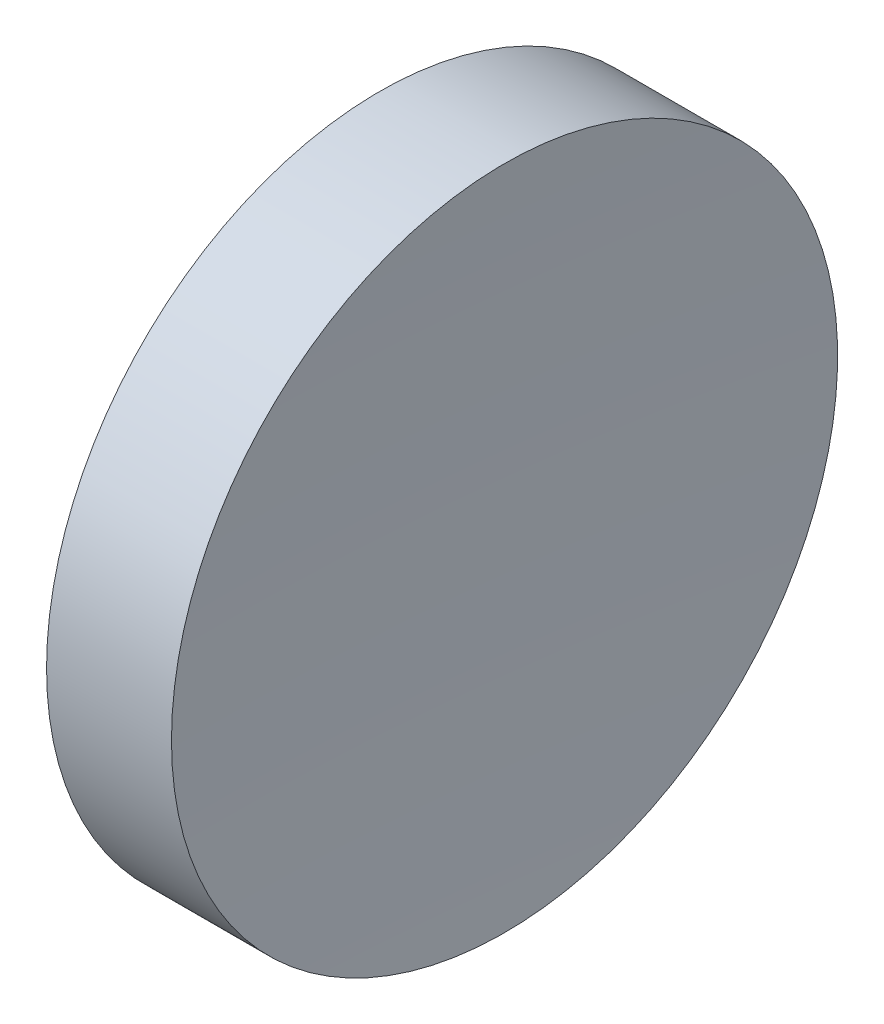
ISO-10303-21;
HEADER;
FILE_DESCRIPTION(('STEP AP214'),'2;1');
FILE_NAME('part.step','',(''),(''),'','','');
FILE_SCHEMA(('AUTOMOTIVE_DESIGN { 1 0 10303 214 1 1 1 1 }'));
ENDSEC;
DATA;
#1=APPLICATION_CONTEXT('core data for automotive mechanical design processes');
#2=APPLICATION_PROTOCOL_DEFINITION('international standard','automotive_design',2000,#1);
#3=PRODUCT_CONTEXT('',#1,'mechanical');
#4=PRODUCT('Part','Part','',(#3));
#5=PRODUCT_RELATED_PRODUCT_CATEGORY('part','',(#4));
#6=PRODUCT_DEFINITION_FORMATION('','',#4);
#7=PRODUCT_DEFINITION_CONTEXT('part definition',#1,'design');
#8=PRODUCT_DEFINITION('design','',#6,#7);
#9=PRODUCT_DEFINITION_SHAPE('','',#8);
#10=(LENGTH_UNIT() NAMED_UNIT(*) SI_UNIT(.MILLI.,.METRE.));
#11=(NAMED_UNIT(*) PLANE_ANGLE_UNIT() SI_UNIT($,.RADIAN.));
#12=(NAMED_UNIT(*) SI_UNIT($,.STERADIAN.) SOLID_ANGLE_UNIT());
#13=UNCERTAINTY_MEASURE_WITH_UNIT(LENGTH_MEASURE(1.E-05),#10,'distance_accuracy_value','');
#14=(GEOMETRIC_REPRESENTATION_CONTEXT(3) GLOBAL_UNCERTAINTY_ASSIGNED_CONTEXT((#13)) GLOBAL_UNIT_ASSIGNED_CONTEXT((#10,
#11,#12)) REPRESENTATION_CONTEXT('',''));
#15=CARTESIAN_POINT('',(0.,0.,0.));
#16=DIRECTION('',(0.,0.,1.));
#17=DIRECTION('',(1.,0.,0.));
#18=AXIS2_PLACEMENT_3D('',#15,#16,#17);
#19=CARTESIAN_POINT('',(0.,0.,0.));
#20=DIRECTION('',(1.,0.,0.));
#21=DIRECTION('',(0.,0.,-1.));
#22=AXIS2_PLACEMENT_3D('',#19,#20,#21);
#23=PLANE('',#22);
#24=CARTESIAN_POINT('',(0.,0.,0.));
#25=DIRECTION('',(-1.,0.,0.));
#26=DIRECTION('',(0.,0.,1.));
#27=AXIS2_PLACEMENT_3D('',#24,#25,#26);
#28=CIRCLE('',#27,25.4);
#29=CARTESIAN_POINT('',(0.,0.,25.4));
#30=VERTEX_POINT('',#29);
#31=EDGE_CURVE('E39',#30,#30,#28,.T.);
#32=ORIENTED_EDGE('',*,*,#31,.T.);
#33=EDGE_LOOP('',(#32));
#34=FACE_BOUND('',#33,.T.);
#35=ADVANCED_FACE('F33',(#34),#23,.F.);
#36=CARTESIAN_POINT('',(508.88,0.,0.));
#37=DIRECTION('',(-1.,0.,0.));
#38=DIRECTION('',(0.,0.,1.));
#39=AXIS2_PLACEMENT_3D('',#36,#37,#38);
#40=SPHERICAL_SURFACE('',#39,500.);
#41=CARTESIAN_POINT('',(9.52557676936516,0.,0.));
#42=DIRECTION('',(-1.,0.,0.));
#43=DIRECTION('',(0.,0.,1.));
#44=AXIS2_PLACEMENT_3D('',#41,#42,#43);
#45=CIRCLE('',#44,25.4000000000001);
#46=CARTESIAN_POINT('',(9.52557676936516,0.,25.4000000000001));
#47=VERTEX_POINT('',#46);
#48=EDGE_CURVE('E10',#47,#47,#45,.T.);
#49=ORIENTED_EDGE('',*,*,#48,.F.);
#50=EDGE_LOOP('',(#49));
#51=FACE_BOUND('',#50,.T.);
#52=ADVANCED_FACE('F48',(#51),#40,.F.);
#53=CARTESIAN_POINT('',(0.,0.,0.));
#54=DIRECTION('',(-1.,0.,0.));
#55=DIRECTION('',(0.,0.,1.));
#56=AXIS2_PLACEMENT_3D('',#53,#54,#55);
#57=CYLINDRICAL_SURFACE('',#56,25.4000000000001);
#58=ORIENTED_EDGE('',*,*,#31,.F.);
#59=EDGE_LOOP('',(#58));
#60=FACE_BOUND('',#59,.T.);
#61=ORIENTED_EDGE('',*,*,#48,.T.);
#62=EDGE_LOOP('',(#61));
#63=FACE_BOUND('',#62,.T.);
#64=ADVANCED_FACE('F46',(#60,#63),#57,.T.);
#65=CLOSED_SHELL('',(#35,#52,#64));
#66=MANIFOLD_SOLID_BREP('B2',#65);
#67=ADVANCED_BREP_SHAPE_REPRESENTATION('',(#18,#66),#14);
#68=SHAPE_DEFINITION_REPRESENTATION(#9,#67);
ENDSEC;
END-ISO-10303-21;
